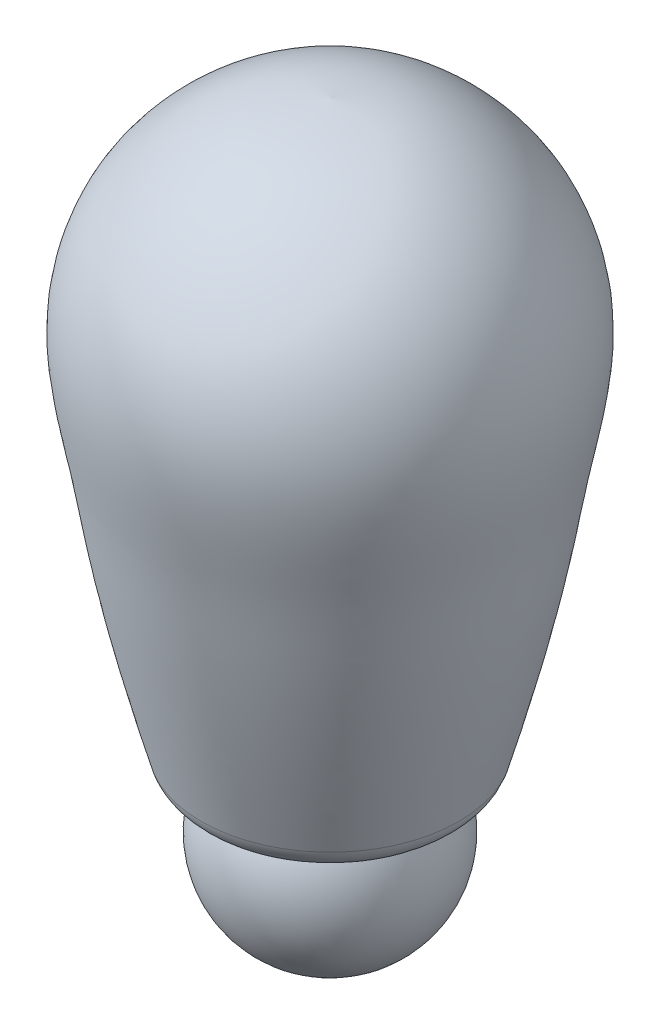
ISO-10303-21;
HEADER;
FILE_DESCRIPTION(('STEP AP214'),'2;1');
FILE_NAME('part.step','',(''),(''),'','','');
FILE_SCHEMA(('AUTOMOTIVE_DESIGN { 1 0 10303 214 1 1 1 1 }'));
ENDSEC;
DATA;
#1=APPLICATION_CONTEXT('core data for automotive mechanical design processes');
#2=APPLICATION_PROTOCOL_DEFINITION('international standard','automotive_design',2000,#1);
#3=PRODUCT_CONTEXT('',#1,'mechanical');
#4=PRODUCT('Part','Part','',(#3));
#5=PRODUCT_RELATED_PRODUCT_CATEGORY('part','',(#4));
#6=PRODUCT_DEFINITION_FORMATION('','',#4);
#7=PRODUCT_DEFINITION_CONTEXT('part definition',#1,'design');
#8=PRODUCT_DEFINITION('design','',#6,#7);
#9=PRODUCT_DEFINITION_SHAPE('','',#8);
#10=(LENGTH_UNIT() NAMED_UNIT(*) SI_UNIT(.MILLI.,.METRE.));
#11=(NAMED_UNIT(*) PLANE_ANGLE_UNIT() SI_UNIT($,.RADIAN.));
#12=(NAMED_UNIT(*) SI_UNIT($,.STERADIAN.) SOLID_ANGLE_UNIT());
#13=UNCERTAINTY_MEASURE_WITH_UNIT(LENGTH_MEASURE(1.E-05),#10,'distance_accuracy_value','');
#14=(GEOMETRIC_REPRESENTATION_CONTEXT(3) GLOBAL_UNCERTAINTY_ASSIGNED_CONTEXT((#13)) GLOBAL_UNIT_ASSIGNED_CONTEXT((#10,
#11,#12)) REPRESENTATION_CONTEXT('',''));
#15=CARTESIAN_POINT('',(0.,0.,0.));
#16=DIRECTION('',(0.,0.,1.));
#17=DIRECTION('',(1.,0.,0.));
#18=AXIS2_PLACEMENT_3D('',#15,#16,#17);
#19=CARTESIAN_POINT('',(0.,-120.681123823423,0.00255645125536284));
#20=DIRECTION('',(0.,1.,0.));
#21=DIRECTION('',(0.,0.,1.));
#22=AXIS2_PLACEMENT_3D('',#19,#20,#21);
#23=PLANE('',#22);
#24=CARTESIAN_POINT('',(0.,-120.681123823423,0.00255645125536284));
#25=DIRECTION('',(0.,1.,0.));
#26=DIRECTION('',(0.,0.,1.));
#27=AXIS2_PLACEMENT_3D('',#24,#25,#26);
#28=CIRCLE('',#27,42.1288395644868);
#29=CARTESIAN_POINT('',(0.,-120.681123823423,42.1313960157421));
#30=VERTEX_POINT('',#29);
#31=EDGE_CURVE('E11',#30,#30,#28,.F.);
#32=ORIENTED_EDGE('',*,*,#31,.T.);
#33=EDGE_LOOP('',(#32));
#34=FACE_BOUND('',#33,.T.);
#35=CARTESIAN_POINT('',(0.,-120.681123823423,0.00255645125536284));
#36=DIRECTION('',(0.,1.,0.));
#37=DIRECTION('',(0.,0.,1.));
#38=AXIS2_PLACEMENT_3D('',#35,#36,#37);
#39=CIRCLE('',#38,39.6877495491354);
#40=CARTESIAN_POINT('',(0.,-120.681123823423,39.6903060003908));
#41=VERTEX_POINT('',#40);
#42=EDGE_CURVE('E64',#41,#41,#39,.F.);
#43=ORIENTED_EDGE('',*,*,#42,.F.);
#44=EDGE_LOOP('',(#43));
#45=FACE_BOUND('',#44,.T.);
#46=ADVANCED_FACE('F36',(#34,#45),#23,.F.);
#47=CARTESIAN_POINT('',(52.8637500000001,-120.681123823423,0.00255645125536284));
#48=CARTESIAN_POINT('',(56.62961460094,-107.054391161975,0.00255645125536284));
#49=CARTESIAN_POINT('',(65.0768795761719,-76.4880714092263,0.00255645125536284));
#50=CARTESIAN_POINT('',(74.0819957914667,-36.1435223460625,0.00255645125536284));
#51=CARTESIAN_POINT('',(81.0705890944784,7.29072437765047,0.00255645125536284));
#52=CARTESIAN_POINT('',(90.4748572202147,45.7954734123737,0.00255645125536284));
#53=CARTESIAN_POINT('',(79.7872253216124,86.073700537648,0.00255645125536284));
#54=CARTESIAN_POINT('',(57.7436707162216,113.880005324272,0.00255645125536284));
#55=CARTESIAN_POINT('',(29.564759554566,130.384446749914,0.00255645125536284));
#56=CARTESIAN_POINT('',(8.88652910572328,132.259196899128,0.00255645125536284));
#57=CARTESIAN_POINT('',(0.,133.064876176577,0.00255645125536284));
#58=B_SPLINE_CURVE_WITH_KNOTS('',3,(#47,#48,#49,#50,#51,#52,#53,#54,#55,#56,#57),.UNSPECIFIED.,
.F.,.F.,(4,1,1,1,1,1,1,1,4),(0.,0.138662681850964,0.311036253262798,0.404515186478313,
0.571307201979708,0.692111377560754,0.797899436604269,0.913146700664624,1.),.UNSPECIFIED.);
#59=CARTESIAN_POINT('',(0.,337.224541546227,0.00255645125536284));
#60=DIRECTION('',(0.,1.,0.));
#61=AXIS1_PLACEMENT('',#59,#60);
#62=SURFACE_OF_REVOLUTION('',#58,#61);
#63=CARTESIAN_POINT('',(0.,-110.319693642265,0.00255645125536284));
#64=DIRECTION('',(0.,1.,0.));
#65=DIRECTION('',(0.,0.,1.));
#66=AXIS2_PLACEMENT_3D('',#63,#64,#65);
#67=CIRCLE('',#66,55.7218865786243);
#68=CARTESIAN_POINT('',(0.,-110.319693642265,55.7244430298797));
#69=VERTEX_POINT('',#68);
#70=EDGE_CURVE('E43',#69,#69,#67,.T.);
#71=ORIENTED_EDGE('',*,*,#70,.T.);
#72=EDGE_LOOP('',(#71));
#73=FACE_BOUND('',#72,.T.);
#74=CARTESIAN_POINT('',(0.,133.064876176577,0.00255645125536284));
#75=VERTEX_POINT('',#74);
#76=VERTEX_LOOP('',#75);
#77=FACE_BOUND('',#76,.T.);
#78=ADVANCED_FACE('F46',(#73,#77),#62,.T.);
#79=CARTESIAN_POINT('',(0.,-141.826623823423,0.00255645125536284));
#80=DIRECTION('',(0.,1.,0.));
#81=DIRECTION('',(1.,0.,0.));
#82=AXIS2_PLACEMENT_3D('',#79,#80,#81);
#83=SPHERICAL_SURFACE('',#82,44.96943);
#84=ORIENTED_EDGE('',*,*,#42,.T.);
#85=EDGE_LOOP('',(#84));
#86=FACE_BOUND('',#85,.T.);
#87=ADVANCED_FACE('F48',(#86),#83,.T.);
#88=CARTESIAN_POINT('',(0.,-106.584123823423,0.00255645125536284));
#89=DIRECTION('',(0.,1.,0.));
#90=DIRECTION('',(0.,0.,1.));
#91=AXIS2_PLACEMENT_3D('',#88,#89,#90);
#92=TOROIDAL_SURFACE('',#91,42.1288395644868,14.097);
#93=ORIENTED_EDGE('',*,*,#31,.F.);
#94=EDGE_LOOP('',(#93));
#95=FACE_BOUND('',#94,.T.);
#96=ORIENTED_EDGE('',*,*,#70,.F.);
#97=EDGE_LOOP('',(#96));
#98=FACE_BOUND('',#97,.T.);
#99=ADVANCED_FACE('F38',(#95,#98),#92,.T.);
#100=CLOSED_SHELL('',(#46,#78,#87,#99));
#101=MANIFOLD_SOLID_BREP('B2',#100);
#102=ADVANCED_BREP_SHAPE_REPRESENTATION('',(#18,#101),#14);
#103=SHAPE_DEFINITION_REPRESENTATION(#9,#102);
ENDSEC;
END-ISO-10303-21;
